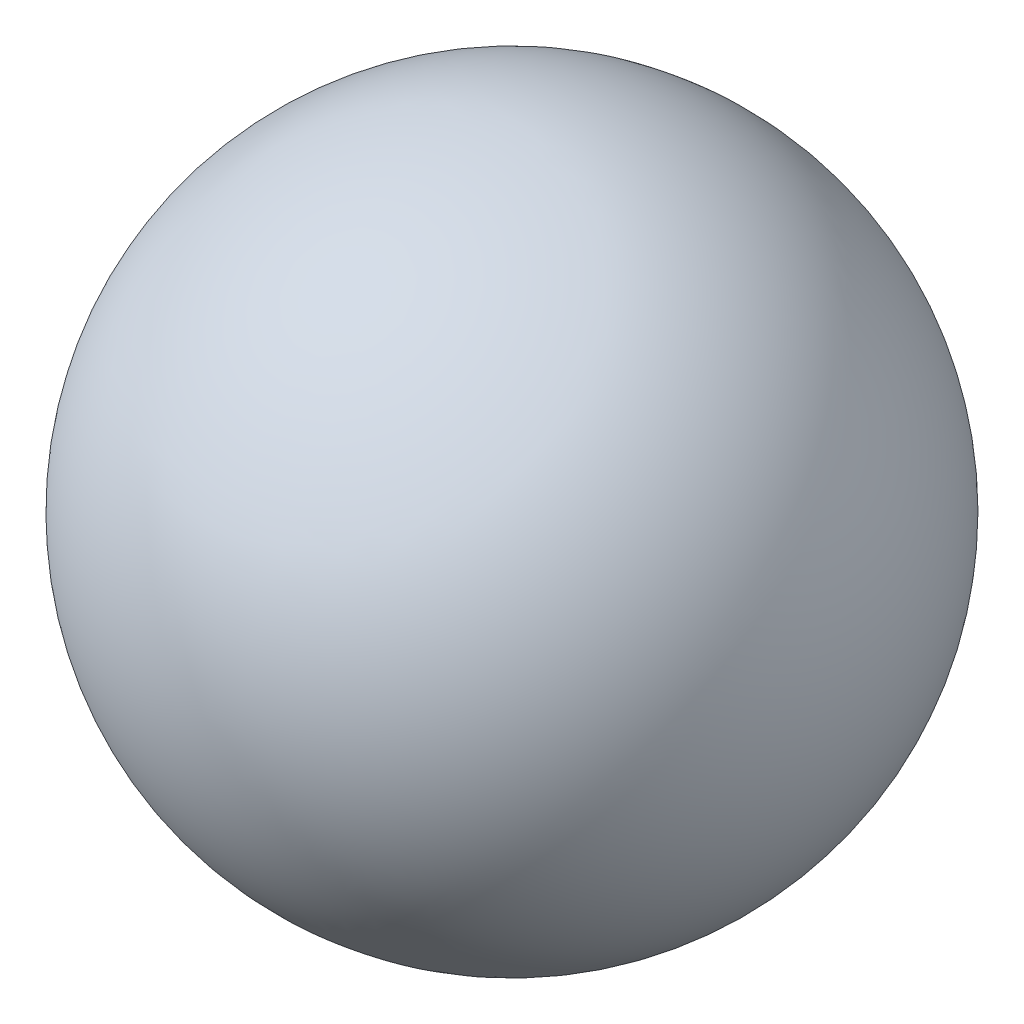
ISO-10303-21;
HEADER;
FILE_DESCRIPTION(('STEP AP214'),'2;1');
FILE_NAME('part.step','',(''),(''),'','','');
FILE_SCHEMA(('AUTOMOTIVE_DESIGN { 1 0 10303 214 1 1 1 1 }'));
ENDSEC;
DATA;
#1=APPLICATION_CONTEXT('core data for automotive mechanical design processes');
#2=APPLICATION_PROTOCOL_DEFINITION('international standard','automotive_design',2000,#1);
#3=PRODUCT_CONTEXT('',#1,'mechanical');
#4=PRODUCT('Part','Part','',(#3));
#5=PRODUCT_RELATED_PRODUCT_CATEGORY('part','',(#4));
#6=PRODUCT_DEFINITION_FORMATION('','',#4);
#7=PRODUCT_DEFINITION_CONTEXT('part definition',#1,'design');
#8=PRODUCT_DEFINITION('design','',#6,#7);
#9=PRODUCT_DEFINITION_SHAPE('','',#8);
#10=(LENGTH_UNIT() NAMED_UNIT(*) SI_UNIT(.MILLI.,.METRE.));
#11=(NAMED_UNIT(*) PLANE_ANGLE_UNIT() SI_UNIT($,.RADIAN.));
#12=(NAMED_UNIT(*) SI_UNIT($,.STERADIAN.) SOLID_ANGLE_UNIT());
#13=UNCERTAINTY_MEASURE_WITH_UNIT(LENGTH_MEASURE(1.E-05),#10,'distance_accuracy_value','');
#14=(GEOMETRIC_REPRESENTATION_CONTEXT(3) GLOBAL_UNCERTAINTY_ASSIGNED_CONTEXT((#13)) GLOBAL_UNIT_ASSIGNED_CONTEXT((#10,
#11,#12)) REPRESENTATION_CONTEXT('',''));
#15=CARTESIAN_POINT('',(0.,0.,0.));
#16=DIRECTION('',(0.,0.,1.));
#17=DIRECTION('',(1.,0.,0.));
#18=AXIS2_PLACEMENT_3D('',#15,#16,#17);
#19=CARTESIAN_POINT('',(64.16,61.8803514678688,-31.3818863552373));
#20=DIRECTION('',(0.,0.891866184337212,-0.452299357987365));
#21=DIRECTION('',(0.173648177666933,0.445427914428401,0.878316732984701));
#22=AXIS2_PLACEMENT_3D('',#19,#20,#21);
#23=SPHERICAL_SURFACE('',#22,7.15);
#24=CARTESIAN_POINT('',(64.16,55.5035082498577,-28.1479459456276));
#25=VERTEX_POINT('',#24);
#26=VERTEX_LOOP('',#25);
#27=FACE_BOUND('',#26,.T.);
#28=CARTESIAN_POINT('',(64.16,68.2571946858799,-34.615826764847));
#29=VERTEX_POINT('',#28);
#30=VERTEX_LOOP('',#29);
#31=FACE_BOUND('',#30,.T.);
#32=ADVANCED_FACE('F15',(#27,#31),#23,.T.);
#33=CLOSED_SHELL('',(#32));
#34=MANIFOLD_SOLID_BREP('B1',#33);
#35=ADVANCED_BREP_SHAPE_REPRESENTATION('',(#18,#34),#14);
#36=SHAPE_DEFINITION_REPRESENTATION(#9,#35);
ENDSEC;
END-ISO-10303-21;
